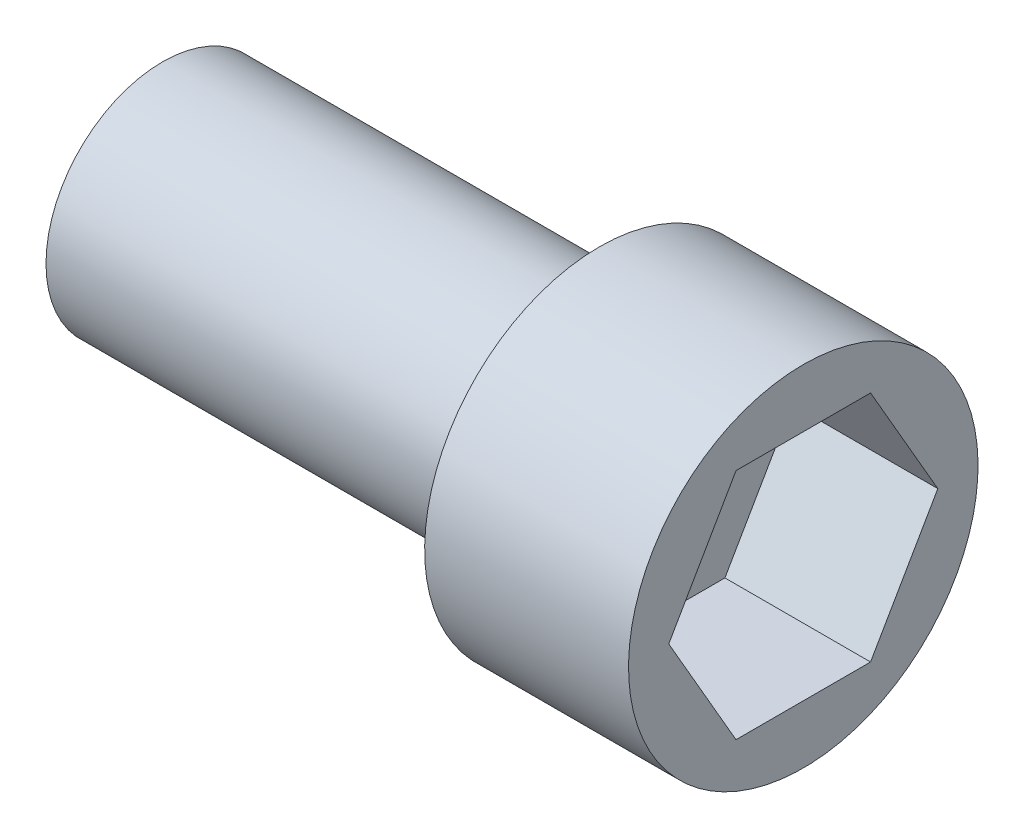
ISO-10303-21;
HEADER;
FILE_DESCRIPTION(('STEP AP214'),'2;1');
FILE_NAME('part.step','',(''),(''),'','','');
FILE_SCHEMA(('AUTOMOTIVE_DESIGN { 1 0 10303 214 1 1 1 1 }'));
ENDSEC;
DATA;
#1=APPLICATION_CONTEXT('core data for automotive mechanical design processes');
#2=APPLICATION_PROTOCOL_DEFINITION('international standard','automotive_design',2000,#1);
#3=PRODUCT_CONTEXT('',#1,'mechanical');
#4=PRODUCT('Part','Part','',(#3));
#5=PRODUCT_RELATED_PRODUCT_CATEGORY('part','',(#4));
#6=PRODUCT_DEFINITION_FORMATION('','',#4);
#7=PRODUCT_DEFINITION_CONTEXT('part definition',#1,'design');
#8=PRODUCT_DEFINITION('design','',#6,#7);
#9=PRODUCT_DEFINITION_SHAPE('','',#8);
#10=(LENGTH_UNIT() NAMED_UNIT(*) SI_UNIT(.MILLI.,.METRE.));
#11=(NAMED_UNIT(*) PLANE_ANGLE_UNIT() SI_UNIT($,.RADIAN.));
#12=(NAMED_UNIT(*) SI_UNIT($,.STERADIAN.) SOLID_ANGLE_UNIT());
#13=UNCERTAINTY_MEASURE_WITH_UNIT(LENGTH_MEASURE(1.E-05),#10,'distance_accuracy_value','');
#14=(GEOMETRIC_REPRESENTATION_CONTEXT(3) GLOBAL_UNCERTAINTY_ASSIGNED_CONTEXT((#13)) GLOBAL_UNIT_ASSIGNED_CONTEXT((#10,
#11,#12)) REPRESENTATION_CONTEXT('',''));
#15=CARTESIAN_POINT('',(0.,0.,0.));
#16=DIRECTION('',(0.,0.,1.));
#17=DIRECTION('',(1.,0.,0.));
#18=AXIS2_PLACEMENT_3D('',#15,#16,#17);
#19=CARTESIAN_POINT('',(11.,6.,0.));
#20=DIRECTION('',(1.,0.,0.));
#21=DIRECTION('',(0.,1.,0.));
#22=AXIS2_PLACEMENT_3D('',#19,#20,#21);
#23=PLANE('',#22);
#24=DIRECTION('',(0.,0.866025403784439,-0.5));
#25=VECTOR('',#24,1.);
#26=CARTESIAN_POINT('',(11.,-4.,-2.3094010767585));
#27=LINE('',#26,#25);
#28=CARTESIAN_POINT('',(11.,-4.,-2.3094010767585));
#29=VERTEX_POINT('',#28);
#30=CARTESIAN_POINT('',(11.,0.,-4.61880215351701));
#31=VERTEX_POINT('',#30);
#32=EDGE_CURVE('E58',#29,#31,#27,.T.);
#33=ORIENTED_EDGE('',*,*,#32,.F.);
#34=DIRECTION('',(0.,0.,-1.));
#35=VECTOR('',#34,1.);
#36=CARTESIAN_POINT('',(11.,-4.,2.3094010767585));
#37=LINE('',#36,#35);
#38=CARTESIAN_POINT('',(11.,-4.,2.3094010767585));
#39=VERTEX_POINT('',#38);
#40=EDGE_CURVE('E151',#39,#29,#37,.T.);
#41=ORIENTED_EDGE('',*,*,#40,.F.);
#42=DIRECTION('',(0.,-0.866025403784438,-0.5));
#43=VECTOR('',#42,1.);
#44=CARTESIAN_POINT('',(11.,0.,4.61880215351701));
#45=LINE('',#44,#43);
#46=CARTESIAN_POINT('',(11.,0.,4.61880215351701));
#47=VERTEX_POINT('',#46);
#48=EDGE_CURVE('E148',#47,#39,#45,.T.);
#49=ORIENTED_EDGE('',*,*,#48,.F.);
#50=DIRECTION('',(0.,-0.866025403784439,0.5));
#51=VECTOR('',#50,1.);
#52=CARTESIAN_POINT('',(11.,4.,2.3094010767585));
#53=LINE('',#52,#51);
#54=CARTESIAN_POINT('',(11.,4.,2.3094010767585));
#55=VERTEX_POINT('',#54);
#56=EDGE_CURVE('E106',#55,#47,#53,.T.);
#57=ORIENTED_EDGE('',*,*,#56,.F.);
#58=DIRECTION('',(0.,0.,1.));
#59=VECTOR('',#58,1.);
#60=CARTESIAN_POINT('',(11.,4.,-2.3094010767585));
#61=LINE('',#60,#59);
#62=CARTESIAN_POINT('',(11.,4.,-2.3094010767585));
#63=VERTEX_POINT('',#62);
#64=EDGE_CURVE('E142',#63,#55,#61,.T.);
#65=ORIENTED_EDGE('',*,*,#64,.F.);
#66=DIRECTION('',(0.,0.866025403784439,0.5));
#67=VECTOR('',#66,1.);
#68=CARTESIAN_POINT('',(11.,0.,-4.61880215351701));
#69=LINE('',#68,#67);
#70=EDGE_CURVE('E138',#31,#63,#69,.T.);
#71=ORIENTED_EDGE('',*,*,#70,.F.);
#72=EDGE_LOOP('',(#33,#41,#49,#57,#65,#71));
#73=FACE_BOUND('',#72,.T.);
#74=CARTESIAN_POINT('',(11.,0.,0.));
#75=DIRECTION('',(1.,0.,0.));
#76=DIRECTION('',(0.,1.,0.));
#77=AXIS2_PLACEMENT_3D('',#74,#75,#76);
#78=CIRCLE('',#77,6.);
#79=CARTESIAN_POINT('',(11.,6.,0.));
#80=VERTEX_POINT('',#79);
#81=EDGE_CURVE('E157',#80,#80,#78,.T.);
#82=ORIENTED_EDGE('',*,*,#81,.T.);
#83=EDGE_LOOP('',(#82));
#84=FACE_BOUND('',#83,.T.);
#85=ADVANCED_FACE('F43',(#73,#84),#23,.T.);
#86=CARTESIAN_POINT('',(-11.,0.,0.));
#87=DIRECTION('',(-1.,0.,0.));
#88=DIRECTION('',(0.,-1.,0.));
#89=AXIS2_PLACEMENT_3D('',#86,#87,#88);
#90=PLANE('',#89);
#91=CARTESIAN_POINT('',(-11.,0.,0.));
#92=DIRECTION('',(1.,0.,0.));
#93=DIRECTION('',(0.,1.,0.));
#94=AXIS2_PLACEMENT_3D('',#91,#92,#93);
#95=CIRCLE('',#94,4.);
#96=CARTESIAN_POINT('',(-11.,4.,0.));
#97=VERTEX_POINT('',#96);
#98=EDGE_CURVE('E11',#97,#97,#95,.T.);
#99=ORIENTED_EDGE('',*,*,#98,.F.);
#100=EDGE_LOOP('',(#99));
#101=FACE_BOUND('',#100,.T.);
#102=ADVANCED_FACE('F182',(#101),#90,.T.);
#103=CARTESIAN_POINT('',(11.,0.,0.));
#104=DIRECTION('',(1.,0.,0.));
#105=DIRECTION('',(0.,1.,0.));
#106=AXIS2_PLACEMENT_3D('',#103,#104,#105);
#107=CYLINDRICAL_SURFACE('',#106,4.);
#108=ORIENTED_EDGE('',*,*,#98,.T.);
#109=EDGE_LOOP('',(#108));
#110=FACE_BOUND('',#109,.T.);
#111=CARTESIAN_POINT('',(4.,0.,0.));
#112=DIRECTION('',(1.,0.,0.));
#113=DIRECTION('',(0.,1.,0.));
#114=AXIS2_PLACEMENT_3D('',#111,#112,#113);
#115=CIRCLE('',#114,4.);
#116=CARTESIAN_POINT('',(4.,4.,0.));
#117=VERTEX_POINT('',#116);
#118=EDGE_CURVE('E51',#117,#117,#115,.T.);
#119=ORIENTED_EDGE('',*,*,#118,.F.);
#120=EDGE_LOOP('',(#119));
#121=FACE_BOUND('',#120,.T.);
#122=ADVANCED_FACE('F180',(#110,#121),#107,.T.);
#123=CARTESIAN_POINT('',(4.,4.,0.));
#124=DIRECTION('',(-1.,0.,0.));
#125=DIRECTION('',(0.,-1.,0.));
#126=AXIS2_PLACEMENT_3D('',#123,#124,#125);
#127=PLANE('',#126);
#128=ORIENTED_EDGE('',*,*,#118,.T.);
#129=EDGE_LOOP('',(#128));
#130=FACE_BOUND('',#129,.T.);
#131=CARTESIAN_POINT('',(4.,0.,0.));
#132=DIRECTION('',(1.,0.,0.));
#133=DIRECTION('',(0.,1.,0.));
#134=AXIS2_PLACEMENT_3D('',#131,#132,#133);
#135=CIRCLE('',#134,6.);
#136=CARTESIAN_POINT('',(4.,6.,0.));
#137=VERTEX_POINT('',#136);
#138=EDGE_CURVE('E170',#137,#137,#135,.T.);
#139=ORIENTED_EDGE('',*,*,#138,.F.);
#140=EDGE_LOOP('',(#139));
#141=FACE_BOUND('',#140,.T.);
#142=ADVANCED_FACE('F177',(#130,#141),#127,.T.);
#143=CARTESIAN_POINT('',(11.,0.,0.));
#144=DIRECTION('',(1.,0.,0.));
#145=DIRECTION('',(0.,1.,0.));
#146=AXIS2_PLACEMENT_3D('',#143,#144,#145);
#147=CYLINDRICAL_SURFACE('',#146,6.);
#148=ORIENTED_EDGE('',*,*,#138,.T.);
#149=EDGE_LOOP('',(#148));
#150=FACE_BOUND('',#149,.T.);
#151=ORIENTED_EDGE('',*,*,#81,.F.);
#152=EDGE_LOOP('',(#151));
#153=FACE_BOUND('',#152,.T.);
#154=ADVANCED_FACE('F189',(#150,#153),#147,.T.);
#155=CARTESIAN_POINT('',(6.,-4.,-2.3094010767585));
#156=DIRECTION('',(0.,-0.5,-0.866025403784439));
#157=DIRECTION('',(0.,0.866025403784439,-0.5));
#158=AXIS2_PLACEMENT_3D('',#155,#156,#157);
#159=PLANE('',#158);
#160=ORIENTED_EDGE('',*,*,#32,.T.);
#161=DIRECTION('',(1.,0.,0.));
#162=VECTOR('',#161,1.);
#163=CARTESIAN_POINT('',(6.,0.,-4.61880215351701));
#164=LINE('',#163,#162);
#165=CARTESIAN_POINT('',(6.,0.,-4.61880215351701));
#166=VERTEX_POINT('',#165);
#167=EDGE_CURVE('E88',#166,#31,#164,.T.);
#168=ORIENTED_EDGE('',*,*,#167,.F.);
#169=DIRECTION('',(0.,0.866025403784439,-0.5));
#170=VECTOR('',#169,1.);
#171=CARTESIAN_POINT('',(6.,-4.,-2.3094010767585));
#172=LINE('',#171,#170);
#173=CARTESIAN_POINT('',(6.,-4.,-2.3094010767585));
#174=VERTEX_POINT('',#173);
#175=EDGE_CURVE('E154',#174,#166,#172,.T.);
#176=ORIENTED_EDGE('',*,*,#175,.F.);
#177=DIRECTION('',(1.,0.,0.));
#178=VECTOR('',#177,1.);
#179=CARTESIAN_POINT('',(6.,-4.,-2.3094010767585));
#180=LINE('',#179,#178);
#181=EDGE_CURVE('E66',#174,#29,#180,.T.);
#182=ORIENTED_EDGE('',*,*,#181,.T.);
#183=EDGE_LOOP('',(#160,#168,#176,#182));
#184=FACE_BOUND('',#183,.T.);
#185=ADVANCED_FACE('F202',(#184),#159,.F.);
#186=CARTESIAN_POINT('',(6.,-4.,2.3094010767585));
#187=DIRECTION('',(0.,-1.,0.));
#188=DIRECTION('',(1.,0.,0.));
#189=AXIS2_PLACEMENT_3D('',#186,#187,#188);
#190=PLANE('',#189);
#191=ORIENTED_EDGE('',*,*,#40,.T.);
#192=ORIENTED_EDGE('',*,*,#181,.F.);
#193=DIRECTION('',(0.,0.,-1.));
#194=VECTOR('',#193,1.);
#195=CARTESIAN_POINT('',(6.,-4.,2.3094010767585));
#196=LINE('',#195,#194);
#197=CARTESIAN_POINT('',(6.,-4.,2.3094010767585));
#198=VERTEX_POINT('',#197);
#199=EDGE_CURVE('E120',#198,#174,#196,.T.);
#200=ORIENTED_EDGE('',*,*,#199,.F.);
#201=DIRECTION('',(1.,0.,0.));
#202=VECTOR('',#201,1.);
#203=CARTESIAN_POINT('',(6.,-4.,2.3094010767585));
#204=LINE('',#203,#202);
#205=EDGE_CURVE('E111',#198,#39,#204,.T.);
#206=ORIENTED_EDGE('',*,*,#205,.T.);
#207=EDGE_LOOP('',(#191,#192,#200,#206));
#208=FACE_BOUND('',#207,.T.);
#209=ADVANCED_FACE('F208',(#208),#190,.F.);
#210=CARTESIAN_POINT('',(6.,0.,4.61880215351701));
#211=DIRECTION('',(0.,-0.5,0.866025403784438));
#212=DIRECTION('',(0.,-0.866025403784439,-0.5));
#213=AXIS2_PLACEMENT_3D('',#210,#211,#212);
#214=PLANE('',#213);
#215=ORIENTED_EDGE('',*,*,#48,.T.);
#216=ORIENTED_EDGE('',*,*,#205,.F.);
#217=DIRECTION('',(0.,-0.866025403784438,-0.5));
#218=VECTOR('',#217,1.);
#219=CARTESIAN_POINT('',(6.,0.,4.61880215351701));
#220=LINE('',#219,#218);
#221=CARTESIAN_POINT('',(6.,0.,4.61880215351701));
#222=VERTEX_POINT('',#221);
#223=EDGE_CURVE('E115',#222,#198,#220,.T.);
#224=ORIENTED_EDGE('',*,*,#223,.F.);
#225=DIRECTION('',(1.,0.,0.));
#226=VECTOR('',#225,1.);
#227=CARTESIAN_POINT('',(6.,0.,4.61880215351701));
#228=LINE('',#227,#226);
#229=EDGE_CURVE('E99',#222,#47,#228,.T.);
#230=ORIENTED_EDGE('',*,*,#229,.T.);
#231=EDGE_LOOP('',(#215,#216,#224,#230));
#232=FACE_BOUND('',#231,.T.);
#233=ADVANCED_FACE('F116',(#232),#214,.F.);
#234=CARTESIAN_POINT('',(6.,4.,2.3094010767585));
#235=DIRECTION('',(0.,0.5,0.866025403784439));
#236=DIRECTION('',(0.,-0.866025403784439,0.5));
#237=AXIS2_PLACEMENT_3D('',#234,#235,#236);
#238=PLANE('',#237);
#239=ORIENTED_EDGE('',*,*,#56,.T.);
#240=ORIENTED_EDGE('',*,*,#229,.F.);
#241=DIRECTION('',(0.,-0.866025403784439,0.5));
#242=VECTOR('',#241,1.);
#243=CARTESIAN_POINT('',(6.,4.,2.3094010767585));
#244=LINE('',#243,#242);
#245=CARTESIAN_POINT('',(6.,4.,2.3094010767585));
#246=VERTEX_POINT('',#245);
#247=EDGE_CURVE('E103',#246,#222,#244,.T.);
#248=ORIENTED_EDGE('',*,*,#247,.F.);
#249=DIRECTION('',(1.,0.,0.));
#250=VECTOR('',#249,1.);
#251=CARTESIAN_POINT('',(6.,4.,2.3094010767585));
#252=LINE('',#251,#250);
#253=EDGE_CURVE('E112',#246,#55,#252,.T.);
#254=ORIENTED_EDGE('',*,*,#253,.T.);
#255=EDGE_LOOP('',(#239,#240,#248,#254));
#256=FACE_BOUND('',#255,.T.);
#257=ADVANCED_FACE('F101',(#256),#238,.F.);
#258=CARTESIAN_POINT('',(6.,4.,-2.3094010767585));
#259=DIRECTION('',(0.,1.,0.));
#260=DIRECTION('',(-1.,0.,0.));
#261=AXIS2_PLACEMENT_3D('',#258,#259,#260);
#262=PLANE('',#261);
#263=ORIENTED_EDGE('',*,*,#64,.T.);
#264=ORIENTED_EDGE('',*,*,#253,.F.);
#265=DIRECTION('',(0.,0.,1.));
#266=VECTOR('',#265,1.);
#267=CARTESIAN_POINT('',(6.,4.,-2.3094010767585));
#268=LINE('',#267,#266);
#269=CARTESIAN_POINT('',(6.,4.,-2.3094010767585));
#270=VERTEX_POINT('',#269);
#271=EDGE_CURVE('E126',#270,#246,#268,.T.);
#272=ORIENTED_EDGE('',*,*,#271,.F.);
#273=DIRECTION('',(1.,0.,0.));
#274=VECTOR('',#273,1.);
#275=CARTESIAN_POINT('',(6.,4.,-2.3094010767585));
#276=LINE('',#275,#274);
#277=EDGE_CURVE('E162',#270,#63,#276,.T.);
#278=ORIENTED_EDGE('',*,*,#277,.T.);
#279=EDGE_LOOP('',(#263,#264,#272,#278));
#280=FACE_BOUND('',#279,.T.);
#281=ADVANCED_FACE('F214',(#280),#262,.F.);
#282=CARTESIAN_POINT('',(6.,0.,-4.61880215351701));
#283=DIRECTION('',(0.,0.5,-0.866025403784438));
#284=DIRECTION('',(0.,0.866025403784439,0.5));
#285=AXIS2_PLACEMENT_3D('',#282,#283,#284);
#286=PLANE('',#285);
#287=ORIENTED_EDGE('',*,*,#70,.T.);
#288=ORIENTED_EDGE('',*,*,#277,.F.);
#289=DIRECTION('',(0.,0.866025403784439,0.5));
#290=VECTOR('',#289,1.);
#291=CARTESIAN_POINT('',(6.,0.,-4.61880215351701));
#292=LINE('',#291,#290);
#293=EDGE_CURVE('E130',#166,#270,#292,.T.);
#294=ORIENTED_EDGE('',*,*,#293,.F.);
#295=ORIENTED_EDGE('',*,*,#167,.T.);
#296=EDGE_LOOP('',(#287,#288,#294,#295));
#297=FACE_BOUND('',#296,.T.);
#298=ADVANCED_FACE('F211',(#297),#286,.F.);
#299=CARTESIAN_POINT('',(6.,0.,0.));
#300=DIRECTION('',(1.,0.,0.));
#301=DIRECTION('',(0.,0.,-1.));
#302=AXIS2_PLACEMENT_3D('',#299,#300,#301);
#303=PLANE('',#302);
#304=ORIENTED_EDGE('',*,*,#175,.T.);
#305=ORIENTED_EDGE('',*,*,#293,.T.);
#306=ORIENTED_EDGE('',*,*,#271,.T.);
#307=ORIENTED_EDGE('',*,*,#247,.T.);
#308=ORIENTED_EDGE('',*,*,#223,.T.);
#309=ORIENTED_EDGE('',*,*,#199,.T.);
#310=EDGE_LOOP('',(#304,#305,#306,#307,#308,#309));
#311=FACE_BOUND('',#310,.T.);
#312=ADVANCED_FACE('F123',(#311),#303,.T.);
#313=CLOSED_SHELL('',(#85,#102,#122,#142,#154,#185,#209,#233,#257,#281,#298,#312));
#314=MANIFOLD_SOLID_BREP('B2',#313);
#315=ADVANCED_BREP_SHAPE_REPRESENTATION('',(#18,#314),#14);
#316=SHAPE_DEFINITION_REPRESENTATION(#9,#315);
ENDSEC;
END-ISO-10303-21;
